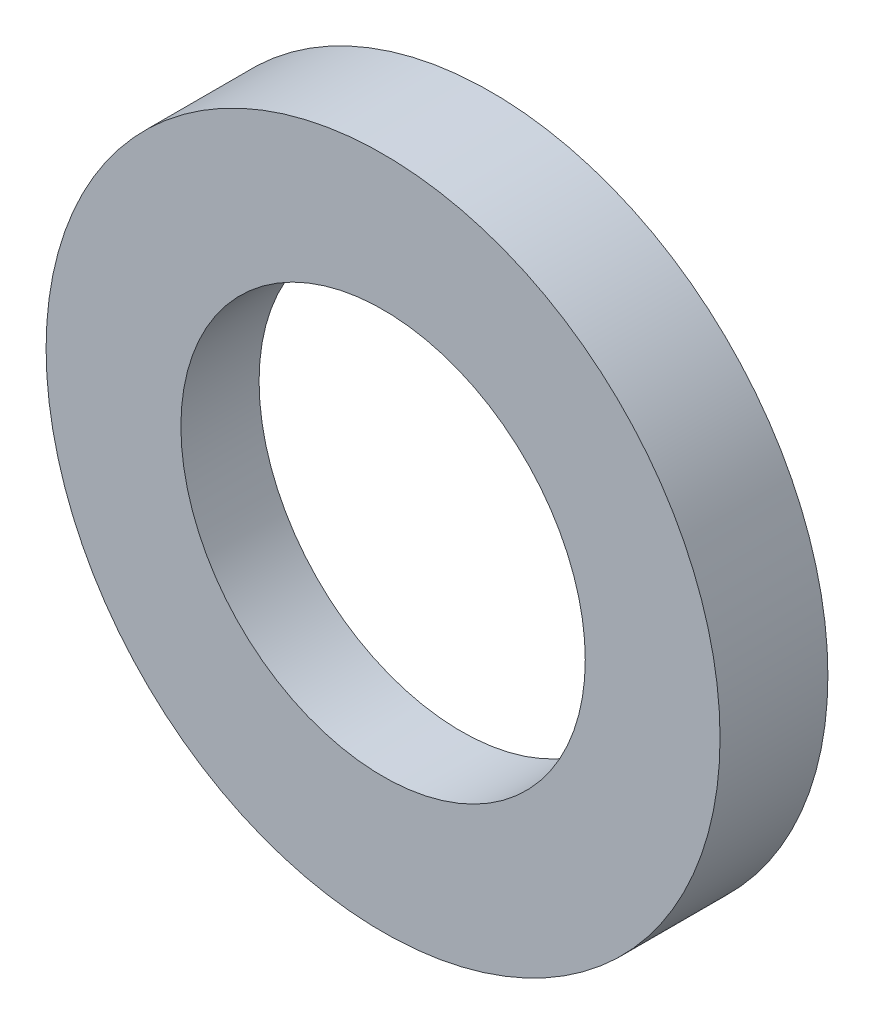
ISO-10303-21;
HEADER;
FILE_DESCRIPTION(('STEP AP214'),'2;1');
FILE_NAME('part.step','',(''),(''),'','','');
FILE_SCHEMA(('AUTOMOTIVE_DESIGN { 1 0 10303 214 1 1 1 1 }'));
ENDSEC;
DATA;
#1=APPLICATION_CONTEXT('core data for automotive mechanical design processes');
#2=APPLICATION_PROTOCOL_DEFINITION('international standard','automotive_design',2000,#1);
#3=PRODUCT_CONTEXT('',#1,'mechanical');
#4=PRODUCT('Part','Part','',(#3));
#5=PRODUCT_RELATED_PRODUCT_CATEGORY('part','',(#4));
#6=PRODUCT_DEFINITION_FORMATION('','',#4);
#7=PRODUCT_DEFINITION_CONTEXT('part definition',#1,'design');
#8=PRODUCT_DEFINITION('design','',#6,#7);
#9=PRODUCT_DEFINITION_SHAPE('','',#8);
#10=(LENGTH_UNIT() NAMED_UNIT(*) SI_UNIT(.MILLI.,.METRE.));
#11=(NAMED_UNIT(*) PLANE_ANGLE_UNIT() SI_UNIT($,.RADIAN.));
#12=(NAMED_UNIT(*) SI_UNIT($,.STERADIAN.) SOLID_ANGLE_UNIT());
#13=UNCERTAINTY_MEASURE_WITH_UNIT(LENGTH_MEASURE(1.E-05),#10,'distance_accuracy_value','');
#14=(GEOMETRIC_REPRESENTATION_CONTEXT(3) GLOBAL_UNCERTAINTY_ASSIGNED_CONTEXT((#13)) GLOBAL_UNIT_ASSIGNED_CONTEXT((#10,
#11,#12)) REPRESENTATION_CONTEXT('',''));
#15=CARTESIAN_POINT('',(0.,0.,0.));
#16=DIRECTION('',(0.,0.,1.));
#17=DIRECTION('',(1.,0.,0.));
#18=AXIS2_PLACEMENT_3D('',#15,#16,#17);
#19=CARTESIAN_POINT('',(0.,0.,10.16));
#20=DIRECTION('',(0.,0.,-1.));
#21=DIRECTION('',(-1.,0.,0.));
#22=AXIS2_PLACEMENT_3D('',#19,#20,#21);
#23=CYLINDRICAL_SURFACE('',#22,19.05);
#24=CARTESIAN_POINT('',(0.,0.,10.16));
#25=DIRECTION('',(0.,0.,1.));
#26=DIRECTION('',(1.,0.,0.));
#27=AXIS2_PLACEMENT_3D('',#24,#25,#26);
#28=CIRCLE('',#27,19.05);
#29=CARTESIAN_POINT('',(19.05,0.,10.16));
#30=VERTEX_POINT('',#29);
#31=EDGE_CURVE('E50',#30,#30,#28,.T.);
#32=ORIENTED_EDGE('',*,*,#31,.T.);
#33=EDGE_LOOP('',(#32));
#34=FACE_BOUND('',#33,.T.);
#35=CARTESIAN_POINT('',(0.,0.,2.794));
#36=DIRECTION('',(0.,0.,-1.));
#37=DIRECTION('',(-1.,0.,0.));
#38=AXIS2_PLACEMENT_3D('',#35,#36,#37);
#39=CIRCLE('',#38,19.05);
#40=CARTESIAN_POINT('',(-19.05,0.,2.794));
#41=VERTEX_POINT('',#40);
#42=EDGE_CURVE('E60',#41,#41,#39,.T.);
#43=ORIENTED_EDGE('',*,*,#42,.T.);
#44=EDGE_LOOP('',(#43));
#45=FACE_BOUND('',#44,.T.);
#46=ADVANCED_FACE('F37',(#34,#45),#23,.F.);
#47=CARTESIAN_POINT('',(0.,0.,10.16));
#48=DIRECTION('',(0.,0.,1.));
#49=DIRECTION('',(1.,0.,0.));
#50=AXIS2_PLACEMENT_3D('',#47,#48,#49);
#51=PLANE('',#50);
#52=CARTESIAN_POINT('',(0.,0.,10.16));
#53=DIRECTION('',(0.,0.,1.));
#54=DIRECTION('',(1.,0.,0.));
#55=AXIS2_PLACEMENT_3D('',#52,#53,#54);
#56=CIRCLE('',#55,31.75);
#57=CARTESIAN_POINT('',(31.75,0.,10.16));
#58=VERTEX_POINT('',#57);
#59=EDGE_CURVE('E10',#58,#58,#56,.T.);
#60=ORIENTED_EDGE('',*,*,#59,.T.);
#61=EDGE_LOOP('',(#60));
#62=FACE_BOUND('',#61,.T.);
#63=ORIENTED_EDGE('',*,*,#31,.F.);
#64=EDGE_LOOP('',(#63));
#65=FACE_BOUND('',#64,.T.);
#66=ADVANCED_FACE('F84',(#62,#65),#51,.T.);
#67=CARTESIAN_POINT('',(0.,0.,0.));
#68=DIRECTION('',(0.,0.,1.));
#69=DIRECTION('',(1.,0.,0.));
#70=AXIS2_PLACEMENT_3D('',#67,#68,#69);
#71=PLANE('',#70);
#72=CARTESIAN_POINT('',(0.,0.,0.));
#73=DIRECTION('',(0.,0.,-1.));
#74=DIRECTION('',(-1.,0.,0.));
#75=AXIS2_PLACEMENT_3D('',#72,#73,#74);
#76=CIRCLE('',#75,25.4);
#77=CARTESIAN_POINT('',(-25.4,0.,0.));
#78=VERTEX_POINT('',#77);
#79=EDGE_CURVE('E56',#78,#78,#76,.T.);
#80=ORIENTED_EDGE('',*,*,#79,.F.);
#81=EDGE_LOOP('',(#80));
#82=FACE_BOUND('',#81,.T.);
#83=CARTESIAN_POINT('',(0.,0.,0.));
#84=DIRECTION('',(0.,0.,1.));
#85=DIRECTION('',(1.,0.,0.));
#86=AXIS2_PLACEMENT_3D('',#83,#84,#85);
#87=CIRCLE('',#86,31.75);
#88=CARTESIAN_POINT('',(31.75,0.,0.));
#89=VERTEX_POINT('',#88);
#90=EDGE_CURVE('E41',#89,#89,#87,.T.);
#91=ORIENTED_EDGE('',*,*,#90,.F.);
#92=EDGE_LOOP('',(#91));
#93=FACE_BOUND('',#92,.T.);
#94=ADVANCED_FACE('F81',(#82,#93),#71,.F.);
#95=CARTESIAN_POINT('',(0.,0.,10.16));
#96=DIRECTION('',(0.,0.,-1.));
#97=DIRECTION('',(-1.,0.,0.));
#98=AXIS2_PLACEMENT_3D('',#95,#96,#97);
#99=CYLINDRICAL_SURFACE('',#98,31.75);
#100=ORIENTED_EDGE('',*,*,#59,.F.);
#101=EDGE_LOOP('',(#100));
#102=FACE_BOUND('',#101,.T.);
#103=ORIENTED_EDGE('',*,*,#90,.T.);
#104=EDGE_LOOP('',(#103));
#105=FACE_BOUND('',#104,.T.);
#106=ADVANCED_FACE('F39',(#102,#105),#99,.T.);
#107=CARTESIAN_POINT('',(0.,0.,2.794));
#108=DIRECTION('',(0.,0.,-1.));
#109=DIRECTION('',(-1.,0.,0.));
#110=AXIS2_PLACEMENT_3D('',#107,#108,#109);
#111=CYLINDRICAL_SURFACE('',#110,25.4);
#112=CARTESIAN_POINT('',(0.,0.,2.794));
#113=DIRECTION('',(0.,0.,-1.));
#114=DIRECTION('',(-1.,0.,0.));
#115=AXIS2_PLACEMENT_3D('',#112,#113,#114);
#116=CIRCLE('',#115,25.4);
#117=CARTESIAN_POINT('',(-25.4,0.,2.794));
#118=VERTEX_POINT('',#117);
#119=EDGE_CURVE('E55',#118,#118,#116,.T.);
#120=ORIENTED_EDGE('',*,*,#119,.F.);
#121=EDGE_LOOP('',(#120));
#122=FACE_BOUND('',#121,.T.);
#123=ORIENTED_EDGE('',*,*,#79,.T.);
#124=EDGE_LOOP('',(#123));
#125=FACE_BOUND('',#124,.T.);
#126=ADVANCED_FACE('F72',(#122,#125),#111,.F.);
#127=CARTESIAN_POINT('',(0.,0.,2.794));
#128=DIRECTION('',(0.,0.,-1.));
#129=DIRECTION('',(-1.,0.,0.));
#130=AXIS2_PLACEMENT_3D('',#127,#128,#129);
#131=PLANE('',#130);
#132=ORIENTED_EDGE('',*,*,#42,.F.);
#133=EDGE_LOOP('',(#132));
#134=FACE_BOUND('',#133,.T.);
#135=ORIENTED_EDGE('',*,*,#119,.T.);
#136=EDGE_LOOP('',(#135));
#137=FACE_BOUND('',#136,.T.);
#138=ADVANCED_FACE('F69',(#134,#137),#131,.T.);
#139=CLOSED_SHELL('',(#46,#66,#94,#106,#126,#138));
#140=MANIFOLD_SOLID_BREP('B2',#139);
#141=ADVANCED_BREP_SHAPE_REPRESENTATION('',(#18,#140),#14);
#142=SHAPE_DEFINITION_REPRESENTATION(#9,#141);
ENDSEC;
END-ISO-10303-21;
